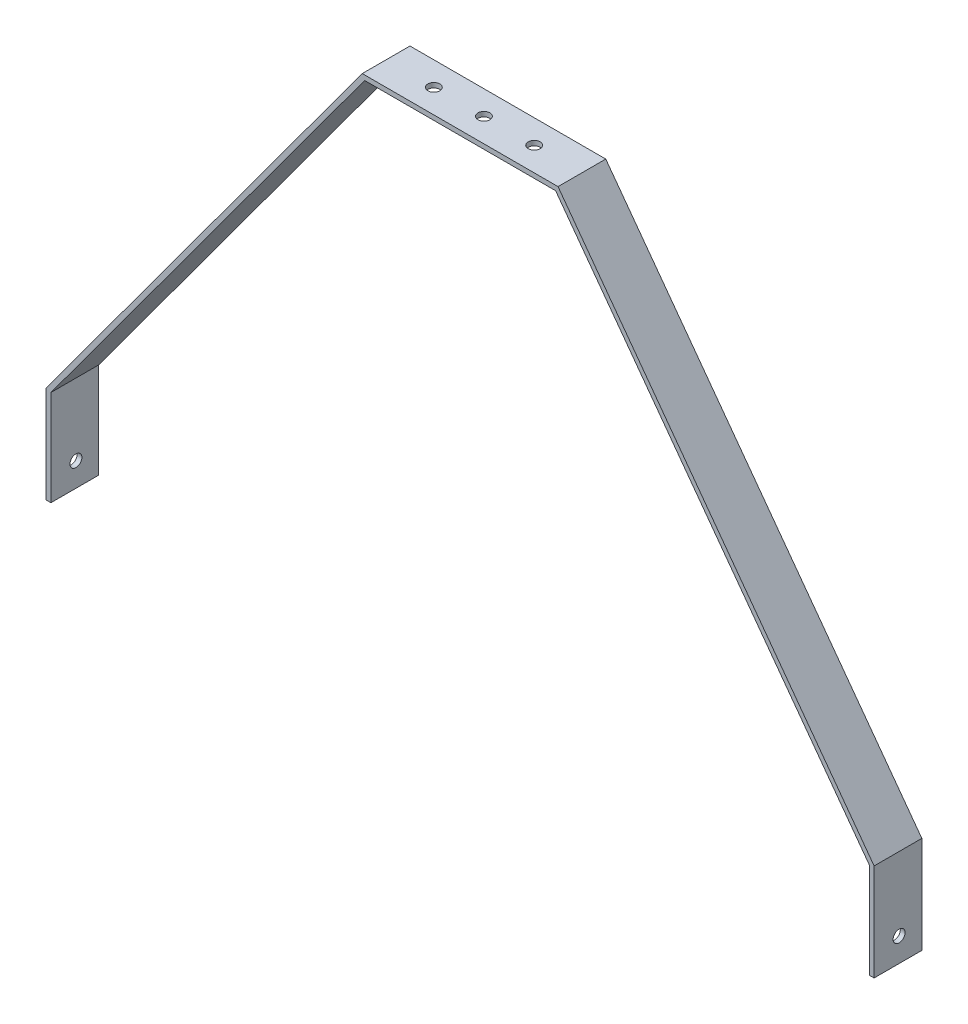
ISO-10303-21;
HEADER;
FILE_DESCRIPTION(('STEP AP214'),'2;1');
FILE_NAME('part.step','',(''),(''),'','','');
FILE_SCHEMA(('AUTOMOTIVE_DESIGN { 1 0 10303 214 1 1 1 1 }'));
ENDSEC;
DATA;
#1=APPLICATION_CONTEXT('core data for automotive mechanical design processes');
#2=APPLICATION_PROTOCOL_DEFINITION('international standard','automotive_design',2000,#1);
#3=PRODUCT_CONTEXT('',#1,'mechanical');
#4=PRODUCT('Part','Part','',(#3));
#5=PRODUCT_RELATED_PRODUCT_CATEGORY('part','',(#4));
#6=PRODUCT_DEFINITION_FORMATION('','',#4);
#7=PRODUCT_DEFINITION_CONTEXT('part definition',#1,'design');
#8=PRODUCT_DEFINITION('design','',#6,#7);
#9=PRODUCT_DEFINITION_SHAPE('','',#8);
#10=(LENGTH_UNIT() NAMED_UNIT(*) SI_UNIT(.MILLI.,.METRE.));
#11=(NAMED_UNIT(*) PLANE_ANGLE_UNIT() SI_UNIT($,.RADIAN.));
#12=(NAMED_UNIT(*) SI_UNIT($,.STERADIAN.) SOLID_ANGLE_UNIT());
#13=UNCERTAINTY_MEASURE_WITH_UNIT(LENGTH_MEASURE(1.E-05),#10,'distance_accuracy_value','');
#14=(GEOMETRIC_REPRESENTATION_CONTEXT(3) GLOBAL_UNCERTAINTY_ASSIGNED_CONTEXT((#13)) GLOBAL_UNIT_ASSIGNED_CONTEXT((#10,
#11,#12)) REPRESENTATION_CONTEXT('',''));
#15=CARTESIAN_POINT('',(0.,0.,0.));
#16=DIRECTION('',(0.,0.,1.));
#17=DIRECTION('',(1.,0.,0.));
#18=AXIS2_PLACEMENT_3D('',#15,#16,#17);
#19=CARTESIAN_POINT('',(-160.103055268466,-153.493142729379,20.));
#20=DIRECTION('',(0.,1.,0.));
#21=DIRECTION('',(0.,0.,1.));
#22=AXIS2_PLACEMENT_3D('',#19,#20,#21);
#23=PLANE('',#22);
#24=DIRECTION('',(1.,0.,0.));
#25=VECTOR('',#24,1.);
#26=CARTESIAN_POINT('',(-160.103055268466,-153.493142729379,0.));
#27=LINE('',#26,#25);
#28=CARTESIAN_POINT('',(-160.103055268466,-153.493142729379,0.));
#29=VERTEX_POINT('',#28);
#30=CARTESIAN_POINT('',(-158.103055268466,-153.493142729379,0.));
#31=VERTEX_POINT('',#30);
#32=EDGE_CURVE('E156',#29,#31,#27,.T.);
#33=ORIENTED_EDGE('',*,*,#32,.T.);
#34=DIRECTION('',(0.,0.,-1.));
#35=VECTOR('',#34,1.);
#36=CARTESIAN_POINT('',(-158.103055268466,-153.493142729379,20.));
#37=LINE('',#36,#35);
#38=CARTESIAN_POINT('',(-158.103055268466,-153.493142729379,20.));
#39=VERTEX_POINT('',#38);
#40=EDGE_CURVE('E11',#39,#31,#37,.T.);
#41=ORIENTED_EDGE('',*,*,#40,.F.);
#42=DIRECTION('',(1.,0.,0.));
#43=VECTOR('',#42,1.);
#44=CARTESIAN_POINT('',(-160.103055268466,-153.493142729379,20.));
#45=LINE('',#44,#43);
#46=CARTESIAN_POINT('',(-160.103055268466,-153.493142729379,20.));
#47=VERTEX_POINT('',#46);
#48=EDGE_CURVE('E179',#47,#39,#45,.T.);
#49=ORIENTED_EDGE('',*,*,#48,.F.);
#50=DIRECTION('',(0.,0.,-1.));
#51=VECTOR('',#50,1.);
#52=CARTESIAN_POINT('',(-160.103055268466,-153.493142729379,20.));
#53=LINE('',#52,#51);
#54=EDGE_CURVE('E152',#47,#29,#53,.T.);
#55=ORIENTED_EDGE('',*,*,#54,.T.);
#56=EDGE_LOOP('',(#33,#41,#49,#55));
#57=FACE_BOUND('',#56,.T.);
#58=ADVANCED_FACE('F34',(#57),#23,.F.);
#59=CARTESIAN_POINT('',(-158.103055268466,-153.493142729379,20.));
#60=DIRECTION('',(-1.,0.,0.));
#61=DIRECTION('',(0.,0.,1.));
#62=AXIS2_PLACEMENT_3D('',#59,#60,#61);
#63=PLANE('',#62);
#64=CARTESIAN_POINT('',(-158.103055268466,-143.493142729378,9.53461030854202));
#65=DIRECTION('',(-1.,0.,0.));
#66=DIRECTION('',(0.,0.,1.));
#67=AXIS2_PLACEMENT_3D('',#64,#65,#66);
#68=CIRCLE('',#67,2.5);
#69=CARTESIAN_POINT('',(-158.103055268466,-143.493142729378,12.034610308542));
#70=VERTEX_POINT('',#69);
#71=EDGE_CURVE('E160',#70,#70,#68,.F.);
#72=ORIENTED_EDGE('',*,*,#71,.F.);
#73=EDGE_LOOP('',(#72));
#74=FACE_BOUND('',#73,.T.);
#75=DIRECTION('',(0.,1.,0.));
#76=VECTOR('',#75,1.);
#77=CARTESIAN_POINT('',(-158.103055268466,-153.493142729379,0.));
#78=LINE('',#77,#76);
#79=CARTESIAN_POINT('',(-158.103055268466,-113.493142729379,0.));
#80=VERTEX_POINT('',#79);
#81=EDGE_CURVE('E159',#31,#80,#78,.T.);
#82=ORIENTED_EDGE('',*,*,#81,.T.);
#83=DIRECTION('',(0.,0.,-1.));
#84=VECTOR('',#83,1.);
#85=CARTESIAN_POINT('',(-158.103055268466,-113.493142729379,20.));
#86=LINE('',#85,#84);
#87=CARTESIAN_POINT('',(-158.103055268466,-113.493142729379,20.));
#88=VERTEX_POINT('',#87);
#89=EDGE_CURVE('E43',#88,#80,#86,.T.);
#90=ORIENTED_EDGE('',*,*,#89,.F.);
#91=DIRECTION('',(0.,1.,0.));
#92=VECTOR('',#91,1.);
#93=CARTESIAN_POINT('',(-158.103055268466,-153.493142729379,20.));
#94=LINE('',#93,#92);
#95=EDGE_CURVE('E107',#39,#88,#94,.T.);
#96=ORIENTED_EDGE('',*,*,#95,.F.);
#97=ORIENTED_EDGE('',*,*,#40,.T.);
#98=EDGE_LOOP('',(#82,#90,#96,#97));
#99=FACE_BOUND('',#98,.T.);
#100=ADVANCED_FACE('F276',(#74,#99),#63,.F.);
#101=CARTESIAN_POINT('',(-158.103055268466,-113.493142729379,20.));
#102=DIRECTION('',(-0.805928282248517,0.592013178799218,0.));
#103=DIRECTION('',(-0.592013178799218,-0.805928282248517,0.));
#104=AXIS2_PLACEMENT_3D('',#101,#102,#103);
#105=PLANE('',#104);
#106=DIRECTION('',(0.592013178799218,0.805928282248517,0.));
#107=VECTOR('',#106,1.);
#108=CARTESIAN_POINT('',(-158.103055268466,-113.493142729379,0.));
#109=LINE('',#108,#107);
#110=CARTESIAN_POINT('',(-26.6761295750399,65.4229359297916,0.));
#111=VERTEX_POINT('',#110);
#112=EDGE_CURVE('E162',#80,#111,#109,.T.);
#113=ORIENTED_EDGE('',*,*,#112,.T.);
#114=DIRECTION('',(0.,0.,-1.));
#115=VECTOR('',#114,1.);
#116=CARTESIAN_POINT('',(-26.6761295750399,65.4229359297916,20.));
#117=LINE('',#116,#115);
#118=CARTESIAN_POINT('',(-26.6761295750399,65.4229359297916,20.));
#119=VERTEX_POINT('',#118);
#120=EDGE_CURVE('E198',#119,#111,#117,.T.);
#121=ORIENTED_EDGE('',*,*,#120,.F.);
#122=DIRECTION('',(0.592013178799218,0.805928282248517,0.));
#123=VECTOR('',#122,1.);
#124=CARTESIAN_POINT('',(-158.103055268466,-113.493142729379,20.));
#125=LINE('',#124,#123);
#126=EDGE_CURVE('E235',#88,#119,#125,.T.);
#127=ORIENTED_EDGE('',*,*,#126,.F.);
#128=ORIENTED_EDGE('',*,*,#89,.T.);
#129=EDGE_LOOP('',(#113,#121,#127,#128));
#130=FACE_BOUND('',#129,.T.);
#131=ADVANCED_FACE('F280',(#130),#105,.F.);
#132=CARTESIAN_POINT('',(-26.6761295750399,65.4229359297916,20.));
#133=DIRECTION('',(0.,1.,0.));
#134=DIRECTION('',(-1.,0.,0.));
#135=AXIS2_PLACEMENT_3D('',#132,#133,#134);
#136=PLANE('',#135);
#137=CARTESIAN_POINT('',(34.336334760031,65.4229359297916,10.));
#138=DIRECTION('',(0.,1.,0.));
#139=DIRECTION('',(-1.,0.,0.));
#140=AXIS2_PLACEMENT_3D('',#137,#138,#139);
#141=CIRCLE('',#140,2.5);
#142=CARTESIAN_POINT('',(31.836334760031,65.4229359297916,10.));
#143=VERTEX_POINT('',#142);
#144=EDGE_CURVE('E210',#143,#143,#141,.F.);
#145=ORIENTED_EDGE('',*,*,#144,.F.);
#146=EDGE_LOOP('',(#145));
#147=FACE_BOUND('',#146,.T.);
#148=CARTESIAN_POINT('',(13.3114060898878,65.4229359297916,9.99999223201455));
#149=DIRECTION('',(0.,1.,0.));
#150=DIRECTION('',(-1.,0.,0.));
#151=AXIS2_PLACEMENT_3D('',#148,#149,#150);
#152=CIRCLE('',#151,2.5);
#153=CARTESIAN_POINT('',(10.8114060898878,65.4229359297916,9.99999223201455));
#154=VERTEX_POINT('',#153);
#155=EDGE_CURVE('E213',#154,#154,#152,.F.);
#156=ORIENTED_EDGE('',*,*,#155,.F.);
#157=EDGE_LOOP('',(#156));
#158=FACE_BOUND('',#157,.T.);
#159=CARTESIAN_POINT('',(-7.68859391011075,65.4229359297916,10.));
#160=DIRECTION('',(0.,1.,0.));
#161=DIRECTION('',(-1.,0.,0.));
#162=AXIS2_PLACEMENT_3D('',#159,#160,#161);
#163=CIRCLE('',#162,2.5);
#164=CARTESIAN_POINT('',(-10.1885939101107,65.4229359297916,10.));
#165=VERTEX_POINT('',#164);
#166=EDGE_CURVE('E207',#165,#165,#163,.F.);
#167=ORIENTED_EDGE('',*,*,#166,.F.);
#168=EDGE_LOOP('',(#167));
#169=FACE_BOUND('',#168,.T.);
#170=DIRECTION('',(1.,0.,0.));
#171=VECTOR('',#170,1.);
#172=CARTESIAN_POINT('',(-26.6761295750399,65.4229359297916,0.));
#173=LINE('',#172,#171);
#174=CARTESIAN_POINT('',(53.3238704249601,65.4229359297916,0.));
#175=VERTEX_POINT('',#174);
#176=EDGE_CURVE('E164',#111,#175,#173,.T.);
#177=ORIENTED_EDGE('',*,*,#176,.T.);
#178=DIRECTION('',(0.,0.,-1.));
#179=VECTOR('',#178,1.);
#180=CARTESIAN_POINT('',(53.3238704249601,65.4229359297916,20.));
#181=LINE('',#180,#179);
#182=CARTESIAN_POINT('',(53.3238704249601,65.4229359297916,20.));
#183=VERTEX_POINT('',#182);
#184=EDGE_CURVE('E195',#183,#175,#181,.T.);
#185=ORIENTED_EDGE('',*,*,#184,.F.);
#186=DIRECTION('',(1.,0.,0.));
#187=VECTOR('',#186,1.);
#188=CARTESIAN_POINT('',(-26.6761295750399,65.4229359297916,20.));
#189=LINE('',#188,#187);
#190=EDGE_CURVE('E237',#119,#183,#189,.T.);
#191=ORIENTED_EDGE('',*,*,#190,.F.);
#192=ORIENTED_EDGE('',*,*,#120,.T.);
#193=EDGE_LOOP('',(#177,#185,#191,#192));
#194=FACE_BOUND('',#193,.T.);
#195=ADVANCED_FACE('F285',(#147,#158,#169,#194),#136,.F.);
#196=CARTESIAN_POINT('',(53.3238704249601,65.4229359297916,20.));
#197=DIRECTION('',(0.805928282248514,0.592013178799222,0.));
#198=DIRECTION('',(-0.592013178799222,0.805928282248514,0.));
#199=AXIS2_PLACEMENT_3D('',#196,#197,#198);
#200=PLANE('',#199);
#201=DIRECTION('',(0.592013178799222,-0.805928282248514,0.));
#202=VECTOR('',#201,1.);
#203=CARTESIAN_POINT('',(53.3238704249601,65.4229359297916,0.));
#204=LINE('',#203,#202);
#205=CARTESIAN_POINT('',(184.750796118387,-113.493142729378,0.));
#206=VERTEX_POINT('',#205);
#207=EDGE_CURVE('E166',#175,#206,#204,.T.);
#208=ORIENTED_EDGE('',*,*,#207,.T.);
#209=DIRECTION('',(0.,0.,-1.));
#210=VECTOR('',#209,1.);
#211=CARTESIAN_POINT('',(184.750796118387,-113.493142729378,20.));
#212=LINE('',#211,#210);
#213=CARTESIAN_POINT('',(184.750796118387,-113.493142729378,20.));
#214=VERTEX_POINT('',#213);
#215=EDGE_CURVE('E192',#214,#206,#212,.T.);
#216=ORIENTED_EDGE('',*,*,#215,.F.);
#217=DIRECTION('',(0.592013178799222,-0.805928282248514,0.));
#218=VECTOR('',#217,1.);
#219=CARTESIAN_POINT('',(53.3238704249601,65.4229359297916,20.));
#220=LINE('',#219,#218);
#221=EDGE_CURVE('E239',#183,#214,#220,.T.);
#222=ORIENTED_EDGE('',*,*,#221,.F.);
#223=ORIENTED_EDGE('',*,*,#184,.T.);
#224=EDGE_LOOP('',(#208,#216,#222,#223));
#225=FACE_BOUND('',#224,.T.);
#226=ADVANCED_FACE('F292',(#225),#200,.F.);
#227=CARTESIAN_POINT('',(184.750796118387,-113.493142729378,20.));
#228=DIRECTION('',(1.,0.,0.));
#229=DIRECTION('',(0.,0.,-1.));
#230=AXIS2_PLACEMENT_3D('',#227,#228,#229);
#231=PLANE('',#230);
#232=CARTESIAN_POINT('',(184.750796118387,-143.493142729378,9.53461030854202));
#233=DIRECTION('',(1.,0.,0.));
#234=DIRECTION('',(0.,0.,-1.));
#235=AXIS2_PLACEMENT_3D('',#232,#233,#234);
#236=CIRCLE('',#235,2.5);
#237=CARTESIAN_POINT('',(184.750796118387,-143.493142729378,7.03461030854202));
#238=VERTEX_POINT('',#237);
#239=EDGE_CURVE('E228',#238,#238,#236,.F.);
#240=ORIENTED_EDGE('',*,*,#239,.F.);
#241=EDGE_LOOP('',(#240));
#242=FACE_BOUND('',#241,.T.);
#243=DIRECTION('',(0.,-1.,0.));
#244=VECTOR('',#243,1.);
#245=CARTESIAN_POINT('',(184.750796118387,-113.493142729378,0.));
#246=LINE('',#245,#244);
#247=CARTESIAN_POINT('',(184.750796118387,-153.493142729378,0.));
#248=VERTEX_POINT('',#247);
#249=EDGE_CURVE('E168',#206,#248,#246,.T.);
#250=ORIENTED_EDGE('',*,*,#249,.T.);
#251=DIRECTION('',(0.,0.,-1.));
#252=VECTOR('',#251,1.);
#253=CARTESIAN_POINT('',(184.750796118387,-153.493142729378,20.));
#254=LINE('',#253,#252);
#255=CARTESIAN_POINT('',(184.750796118387,-153.493142729378,20.));
#256=VERTEX_POINT('',#255);
#257=EDGE_CURVE('E189',#256,#248,#254,.T.);
#258=ORIENTED_EDGE('',*,*,#257,.F.);
#259=DIRECTION('',(0.,-1.,0.));
#260=VECTOR('',#259,1.);
#261=CARTESIAN_POINT('',(184.750796118387,-113.493142729378,20.));
#262=LINE('',#261,#260);
#263=EDGE_CURVE('E241',#214,#256,#262,.T.);
#264=ORIENTED_EDGE('',*,*,#263,.F.);
#265=ORIENTED_EDGE('',*,*,#215,.T.);
#266=EDGE_LOOP('',(#250,#258,#264,#265));
#267=FACE_BOUND('',#266,.T.);
#268=ADVANCED_FACE('F296',(#242,#267),#231,.F.);
#269=CARTESIAN_POINT('',(184.750796118387,-153.493142729378,20.));
#270=DIRECTION('',(0.,1.,0.));
#271=DIRECTION('',(0.,0.,1.));
#272=AXIS2_PLACEMENT_3D('',#269,#270,#271);
#273=PLANE('',#272);
#274=DIRECTION('',(1.,0.,0.));
#275=VECTOR('',#274,1.);
#276=CARTESIAN_POINT('',(184.750796118387,-153.493142729378,0.));
#277=LINE('',#276,#275);
#278=CARTESIAN_POINT('',(186.750796118388,-153.493142729378,0.));
#279=VERTEX_POINT('',#278);
#280=EDGE_CURVE('E170',#248,#279,#277,.T.);
#281=ORIENTED_EDGE('',*,*,#280,.T.);
#282=DIRECTION('',(0.,0.,-1.));
#283=VECTOR('',#282,1.);
#284=CARTESIAN_POINT('',(186.750796118388,-153.493142729378,20.));
#285=LINE('',#284,#283);
#286=CARTESIAN_POINT('',(186.750796118388,-153.493142729378,20.));
#287=VERTEX_POINT('',#286);
#288=EDGE_CURVE('E186',#287,#279,#285,.T.);
#289=ORIENTED_EDGE('',*,*,#288,.F.);
#290=DIRECTION('',(1.,0.,0.));
#291=VECTOR('',#290,1.);
#292=CARTESIAN_POINT('',(184.750796118387,-153.493142729378,20.));
#293=LINE('',#292,#291);
#294=EDGE_CURVE('E243',#256,#287,#293,.T.);
#295=ORIENTED_EDGE('',*,*,#294,.F.);
#296=ORIENTED_EDGE('',*,*,#257,.T.);
#297=EDGE_LOOP('',(#281,#289,#295,#296));
#298=FACE_BOUND('',#297,.T.);
#299=ADVANCED_FACE('F300',(#298),#273,.F.);
#300=CARTESIAN_POINT('',(186.750796118388,-153.493142729378,20.));
#301=DIRECTION('',(-1.,0.,0.));
#302=DIRECTION('',(0.,0.,1.));
#303=AXIS2_PLACEMENT_3D('',#300,#301,#302);
#304=PLANE('',#303);
#305=CARTESIAN_POINT('',(186.750796118388,-143.493142729378,9.53461030854202));
#306=DIRECTION('',(-1.,0.,0.));
#307=DIRECTION('',(0.,0.,1.));
#308=AXIS2_PLACEMENT_3D('',#305,#306,#307);
#309=CIRCLE('',#308,2.5);
#310=CARTESIAN_POINT('',(186.750796118388,-143.493142729378,12.034610308542));
#311=VERTEX_POINT('',#310);
#312=EDGE_CURVE('E206',#311,#311,#309,.F.);
#313=ORIENTED_EDGE('',*,*,#312,.F.);
#314=EDGE_LOOP('',(#313));
#315=FACE_BOUND('',#314,.T.);
#316=DIRECTION('',(0.,1.,0.));
#317=VECTOR('',#316,1.);
#318=CARTESIAN_POINT('',(186.750796118388,-153.493142729378,0.));
#319=LINE('',#318,#317);
#320=CARTESIAN_POINT('',(186.750796118388,-112.837509629639,0.));
#321=VERTEX_POINT('',#320);
#322=EDGE_CURVE('E172',#279,#321,#319,.T.);
#323=ORIENTED_EDGE('',*,*,#322,.T.);
#324=DIRECTION('',(0.,0.,-1.));
#325=VECTOR('',#324,1.);
#326=CARTESIAN_POINT('',(186.750796118388,-112.837509629639,20.));
#327=LINE('',#326,#325);
#328=CARTESIAN_POINT('',(186.750796118388,-112.837509629639,20.));
#329=VERTEX_POINT('',#328);
#330=EDGE_CURVE('E183',#329,#321,#327,.T.);
#331=ORIENTED_EDGE('',*,*,#330,.F.);
#332=DIRECTION('',(0.,1.,0.));
#333=VECTOR('',#332,1.);
#334=CARTESIAN_POINT('',(186.750796118388,-153.493142729378,20.));
#335=LINE('',#334,#333);
#336=EDGE_CURVE('E245',#287,#329,#335,.T.);
#337=ORIENTED_EDGE('',*,*,#336,.F.);
#338=ORIENTED_EDGE('',*,*,#288,.T.);
#339=EDGE_LOOP('',(#323,#331,#337,#338));
#340=FACE_BOUND('',#339,.T.);
#341=ADVANCED_FACE('F251',(#315,#340),#304,.F.);
#342=CARTESIAN_POINT('',(186.750796118388,-112.837509629639,20.));
#343=DIRECTION('',(-0.805928282248514,-0.592013178799223,0.));
#344=DIRECTION('',(0.592013178799223,-0.805928282248514,0.));
#345=AXIS2_PLACEMENT_3D('',#342,#343,#344);
#346=PLANE('',#345);
#347=DIRECTION('',(-0.592013178799223,0.805928282248514,0.));
#348=VECTOR('',#347,1.);
#349=CARTESIAN_POINT('',(186.750796118388,-112.837509629639,0.));
#350=LINE('',#349,#348);
#351=CARTESIAN_POINT('',(54.336334760031,67.4229359297916,0.));
#352=VERTEX_POINT('',#351);
#353=EDGE_CURVE('E174',#321,#352,#350,.T.);
#354=ORIENTED_EDGE('',*,*,#353,.T.);
#355=DIRECTION('',(0.,0.,-1.));
#356=VECTOR('',#355,1.);
#357=CARTESIAN_POINT('',(54.336334760031,67.4229359297916,20.));
#358=LINE('',#357,#356);
#359=CARTESIAN_POINT('',(54.336334760031,67.4229359297916,20.));
#360=VERTEX_POINT('',#359);
#361=EDGE_CURVE('E147',#360,#352,#358,.T.);
#362=ORIENTED_EDGE('',*,*,#361,.F.);
#363=DIRECTION('',(-0.592013178799223,0.805928282248514,0.));
#364=VECTOR('',#363,1.);
#365=CARTESIAN_POINT('',(186.750796118388,-112.837509629639,20.));
#366=LINE('',#365,#364);
#367=EDGE_CURVE('E138',#329,#360,#366,.T.);
#368=ORIENTED_EDGE('',*,*,#367,.F.);
#369=ORIENTED_EDGE('',*,*,#330,.T.);
#370=EDGE_LOOP('',(#354,#362,#368,#369));
#371=FACE_BOUND('',#370,.T.);
#372=ADVANCED_FACE('F255',(#371),#346,.F.);
#373=CARTESIAN_POINT('',(54.336334760031,67.4229359297916,20.));
#374=DIRECTION('',(0.,-1.,0.));
#375=DIRECTION('',(1.,0.,0.));
#376=AXIS2_PLACEMENT_3D('',#373,#374,#375);
#377=PLANE('',#376);
#378=CARTESIAN_POINT('',(34.336334760031,67.4229359297916,10.));
#379=DIRECTION('',(0.,-1.,0.));
#380=DIRECTION('',(1.,0.,0.));
#381=AXIS2_PLACEMENT_3D('',#378,#379,#380);
#382=CIRCLE('',#381,2.5);
#383=CARTESIAN_POINT('',(36.836334760031,67.4229359297916,10.));
#384=VERTEX_POINT('',#383);
#385=EDGE_CURVE('E37',#384,#384,#382,.F.);
#386=ORIENTED_EDGE('',*,*,#385,.F.);
#387=EDGE_LOOP('',(#386));
#388=FACE_BOUND('',#387,.T.);
#389=CARTESIAN_POINT('',(13.3114060898878,67.4229359297916,9.99999223201455));
#390=DIRECTION('',(0.,-1.,0.));
#391=DIRECTION('',(1.,0.,0.));
#392=AXIS2_PLACEMENT_3D('',#389,#390,#391);
#393=CIRCLE('',#392,2.5);
#394=CARTESIAN_POINT('',(15.8114060898878,67.4229359297916,9.99999223201455));
#395=VERTEX_POINT('',#394);
#396=EDGE_CURVE('E211',#395,#395,#393,.F.);
#397=ORIENTED_EDGE('',*,*,#396,.F.);
#398=EDGE_LOOP('',(#397));
#399=FACE_BOUND('',#398,.T.);
#400=CARTESIAN_POINT('',(-7.68859391011075,67.4229359297916,10.));
#401=DIRECTION('',(0.,-1.,0.));
#402=DIRECTION('',(1.,0.,0.));
#403=AXIS2_PLACEMENT_3D('',#400,#401,#402);
#404=CIRCLE('',#403,2.5);
#405=CARTESIAN_POINT('',(-5.18859391011075,67.4229359297916,10.));
#406=VERTEX_POINT('',#405);
#407=EDGE_CURVE('E208',#406,#406,#404,.F.);
#408=ORIENTED_EDGE('',*,*,#407,.F.);
#409=EDGE_LOOP('',(#408));
#410=FACE_BOUND('',#409,.T.);
#411=DIRECTION('',(-1.,0.,0.));
#412=VECTOR('',#411,1.);
#413=CARTESIAN_POINT('',(54.336334760031,67.4229359297916,0.));
#414=LINE('',#413,#412);
#415=CARTESIAN_POINT('',(-27.6885939101107,67.4229359297916,0.));
#416=VERTEX_POINT('',#415);
#417=EDGE_CURVE('E146',#352,#416,#414,.T.);
#418=ORIENTED_EDGE('',*,*,#417,.T.);
#419=DIRECTION('',(0.,0.,-1.));
#420=VECTOR('',#419,1.);
#421=CARTESIAN_POINT('',(-27.6885939101107,67.4229359297916,20.));
#422=LINE('',#421,#420);
#423=CARTESIAN_POINT('',(-27.6885939101107,67.4229359297916,20.));
#424=VERTEX_POINT('',#423);
#425=EDGE_CURVE('E143',#424,#416,#422,.T.);
#426=ORIENTED_EDGE('',*,*,#425,.F.);
#427=DIRECTION('',(-1.,0.,0.));
#428=VECTOR('',#427,1.);
#429=CARTESIAN_POINT('',(54.336334760031,67.4229359297916,20.));
#430=LINE('',#429,#428);
#431=EDGE_CURVE('E132',#360,#424,#430,.T.);
#432=ORIENTED_EDGE('',*,*,#431,.F.);
#433=ORIENTED_EDGE('',*,*,#361,.T.);
#434=EDGE_LOOP('',(#418,#426,#432,#433));
#435=FACE_BOUND('',#434,.T.);
#436=ADVANCED_FACE('F144',(#388,#399,#410,#435),#377,.F.);
#437=CARTESIAN_POINT('',(-27.6885939101107,67.4229359297916,20.));
#438=DIRECTION('',(0.805928282248517,-0.592013178799218,0.));
#439=DIRECTION('',(0.592013178799218,0.805928282248517,0.));
#440=AXIS2_PLACEMENT_3D('',#437,#438,#439);
#441=PLANE('',#440);
#442=DIRECTION('',(-0.592013178799218,-0.805928282248517,0.));
#443=VECTOR('',#442,1.);
#444=CARTESIAN_POINT('',(-27.6885939101107,67.4229359297916,0.));
#445=LINE('',#444,#443);
#446=CARTESIAN_POINT('',(-160.103055268466,-112.837509629639,0.));
#447=VERTEX_POINT('',#446);
#448=EDGE_CURVE('E93',#416,#447,#445,.T.);
#449=ORIENTED_EDGE('',*,*,#448,.T.);
#450=DIRECTION('',(0.,0.,-1.));
#451=VECTOR('',#450,1.);
#452=CARTESIAN_POINT('',(-160.103055268466,-112.837509629639,20.));
#453=LINE('',#452,#451);
#454=CARTESIAN_POINT('',(-160.103055268466,-112.837509629639,20.));
#455=VERTEX_POINT('',#454);
#456=EDGE_CURVE('E148',#455,#447,#453,.T.);
#457=ORIENTED_EDGE('',*,*,#456,.F.);
#458=DIRECTION('',(-0.592013178799218,-0.805928282248517,0.));
#459=VECTOR('',#458,1.);
#460=CARTESIAN_POINT('',(-27.6885939101107,67.4229359297916,20.));
#461=LINE('',#460,#459);
#462=EDGE_CURVE('E136',#424,#455,#461,.T.);
#463=ORIENTED_EDGE('',*,*,#462,.F.);
#464=ORIENTED_EDGE('',*,*,#425,.T.);
#465=EDGE_LOOP('',(#449,#457,#463,#464));
#466=FACE_BOUND('',#465,.T.);
#467=ADVANCED_FACE('F150',(#466),#441,.F.);
#468=CARTESIAN_POINT('',(-160.103055268466,-112.837509629639,20.));
#469=DIRECTION('',(1.,0.,0.));
#470=DIRECTION('',(0.,1.,0.));
#471=AXIS2_PLACEMENT_3D('',#468,#469,#470);
#472=PLANE('',#471);
#473=CARTESIAN_POINT('',(-160.103055268466,-143.493142729378,9.53461030854202));
#474=DIRECTION('',(1.,0.,0.));
#475=DIRECTION('',(0.,1.,0.));
#476=AXIS2_PLACEMENT_3D('',#473,#474,#475);
#477=CIRCLE('',#476,2.5);
#478=CARTESIAN_POINT('',(-160.103055268466,-140.993142729378,9.53461030854202));
#479=VERTEX_POINT('',#478);
#480=EDGE_CURVE('E203',#479,#479,#477,.F.);
#481=ORIENTED_EDGE('',*,*,#480,.F.);
#482=EDGE_LOOP('',(#481));
#483=FACE_BOUND('',#482,.T.);
#484=DIRECTION('',(0.,-1.,0.));
#485=VECTOR('',#484,1.);
#486=CARTESIAN_POINT('',(-160.103055268466,-112.837509629639,0.));
#487=LINE('',#486,#485);
#488=EDGE_CURVE('E99',#447,#29,#487,.T.);
#489=ORIENTED_EDGE('',*,*,#488,.T.);
#490=ORIENTED_EDGE('',*,*,#54,.F.);
#491=DIRECTION('',(0.,-1.,0.));
#492=VECTOR('',#491,1.);
#493=CARTESIAN_POINT('',(-160.103055268466,-112.837509629639,20.));
#494=LINE('',#493,#492);
#495=EDGE_CURVE('E52',#455,#47,#494,.T.);
#496=ORIENTED_EDGE('',*,*,#495,.F.);
#497=ORIENTED_EDGE('',*,*,#456,.T.);
#498=EDGE_LOOP('',(#489,#490,#496,#497));
#499=FACE_BOUND('',#498,.T.);
#500=ADVANCED_FACE('F263',(#483,#499),#472,.F.);
#501=CARTESIAN_POINT('',(0.,0.,20.));
#502=DIRECTION('',(0.,0.,1.));
#503=DIRECTION('',(1.,0.,0.));
#504=AXIS2_PLACEMENT_3D('',#501,#502,#503);
#505=PLANE('',#504);
#506=ORIENTED_EDGE('',*,*,#48,.T.);
#507=ORIENTED_EDGE('',*,*,#95,.T.);
#508=ORIENTED_EDGE('',*,*,#126,.T.);
#509=ORIENTED_EDGE('',*,*,#190,.T.);
#510=ORIENTED_EDGE('',*,*,#221,.T.);
#511=ORIENTED_EDGE('',*,*,#263,.T.);
#512=ORIENTED_EDGE('',*,*,#294,.T.);
#513=ORIENTED_EDGE('',*,*,#336,.T.);
#514=ORIENTED_EDGE('',*,*,#367,.T.);
#515=ORIENTED_EDGE('',*,*,#431,.T.);
#516=ORIENTED_EDGE('',*,*,#462,.T.);
#517=ORIENTED_EDGE('',*,*,#495,.T.);
#518=EDGE_LOOP('',(#506,#507,#508,#509,#510,#511,#512,#513,#514,#515,#516,#517));
#519=FACE_BOUND('',#518,.T.);
#520=ADVANCED_FACE('F134',(#519),#505,.T.);
#521=CARTESIAN_POINT('',(0.,0.,0.));
#522=DIRECTION('',(0.,0.,1.));
#523=DIRECTION('',(1.,0.,0.));
#524=AXIS2_PLACEMENT_3D('',#521,#522,#523);
#525=PLANE('',#524);
#526=ORIENTED_EDGE('',*,*,#32,.F.);
#527=ORIENTED_EDGE('',*,*,#488,.F.);
#528=ORIENTED_EDGE('',*,*,#448,.F.);
#529=ORIENTED_EDGE('',*,*,#417,.F.);
#530=ORIENTED_EDGE('',*,*,#353,.F.);
#531=ORIENTED_EDGE('',*,*,#322,.F.);
#532=ORIENTED_EDGE('',*,*,#280,.F.);
#533=ORIENTED_EDGE('',*,*,#249,.F.);
#534=ORIENTED_EDGE('',*,*,#207,.F.);
#535=ORIENTED_EDGE('',*,*,#176,.F.);
#536=ORIENTED_EDGE('',*,*,#112,.F.);
#537=ORIENTED_EDGE('',*,*,#81,.F.);
#538=EDGE_LOOP('',(#526,#527,#528,#529,#530,#531,#532,#533,#534,#535,#536,#537));
#539=FACE_BOUND('',#538,.T.);
#540=ADVANCED_FACE('F258',(#539),#525,.F.);
#541=CARTESIAN_POINT('',(276.750796118387,-143.493142729378,9.53461030854202));
#542=DIRECTION('',(-1.,0.,0.));
#543=DIRECTION('',(0.,0.,1.));
#544=AXIS2_PLACEMENT_3D('',#541,#542,#543);
#545=CYLINDRICAL_SURFACE('',#544,2.5);
#546=ORIENTED_EDGE('',*,*,#480,.T.);
#547=EDGE_LOOP('',(#546));
#548=FACE_BOUND('',#547,.T.);
#549=ORIENTED_EDGE('',*,*,#71,.T.);
#550=EDGE_LOOP('',(#549));
#551=FACE_BOUND('',#550,.T.);
#552=ADVANCED_FACE('F347',(#548,#551),#545,.F.);
#553=ORIENTED_EDGE('',*,*,#312,.T.);
#554=EDGE_LOOP('',(#553));
#555=FACE_BOUND('',#554,.T.);
#556=ORIENTED_EDGE('',*,*,#239,.T.);
#557=EDGE_LOOP('',(#556));
#558=FACE_BOUND('',#557,.T.);
#559=ADVANCED_FACE('F323',(#555,#558),#545,.F.);
#560=CARTESIAN_POINT('',(-7.68859391011076,114.422935929792,10.));
#561=DIRECTION('',(0.,-1.,0.));
#562=DIRECTION('',(1.,0.,0.));
#563=AXIS2_PLACEMENT_3D('',#560,#561,#562);
#564=CYLINDRICAL_SURFACE('',#563,2.5);
#565=ORIENTED_EDGE('',*,*,#407,.T.);
#566=EDGE_LOOP('',(#565));
#567=FACE_BOUND('',#566,.T.);
#568=ORIENTED_EDGE('',*,*,#166,.T.);
#569=EDGE_LOOP('',(#568));
#570=FACE_BOUND('',#569,.T.);
#571=ADVANCED_FACE('F319',(#567,#570),#564,.F.);
#572=CARTESIAN_POINT('',(13.3114060898878,114.422935929792,9.99999223201455));
#573=DIRECTION('',(0.,-1.,0.));
#574=DIRECTION('',(1.,0.,0.));
#575=AXIS2_PLACEMENT_3D('',#572,#573,#574);
#576=CYLINDRICAL_SURFACE('',#575,2.5);
#577=ORIENTED_EDGE('',*,*,#396,.T.);
#578=EDGE_LOOP('',(#577));
#579=FACE_BOUND('',#578,.T.);
#580=ORIENTED_EDGE('',*,*,#155,.T.);
#581=EDGE_LOOP('',(#580));
#582=FACE_BOUND('',#581,.T.);
#583=ADVANCED_FACE('F322',(#579,#582),#576,.F.);
#584=CARTESIAN_POINT('',(34.336334760031,114.422935929792,10.));
#585=DIRECTION('',(0.,-1.,0.));
#586=DIRECTION('',(1.,0.,0.));
#587=AXIS2_PLACEMENT_3D('',#584,#585,#586);
#588=CYLINDRICAL_SURFACE('',#587,2.5);
#589=ORIENTED_EDGE('',*,*,#385,.T.);
#590=EDGE_LOOP('',(#589));
#591=FACE_BOUND('',#590,.T.);
#592=ORIENTED_EDGE('',*,*,#144,.T.);
#593=EDGE_LOOP('',(#592));
#594=FACE_BOUND('',#593,.T.);
#595=ADVANCED_FACE('F345',(#591,#594),#588,.F.);
#596=CLOSED_SHELL('',(#58,#100,#131,#195,#226,#268,#299,#341,#372,#436,#467,#500,#520,#540,#552,
#559,#571,#583,#595));
#597=MANIFOLD_SOLID_BREP('B2',#596);
#598=ADVANCED_BREP_SHAPE_REPRESENTATION('',(#18,#597),#14);
#599=SHAPE_DEFINITION_REPRESENTATION(#9,#598);
ENDSEC;
END-ISO-10303-21;
